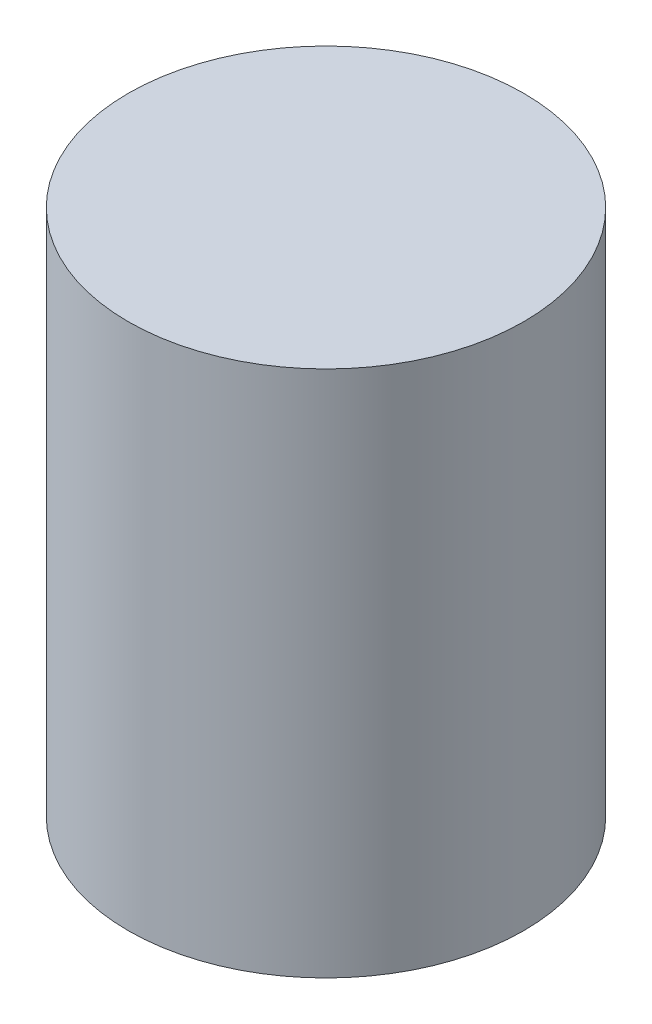
ISO-10303-21;
HEADER;
FILE_DESCRIPTION(('STEP AP214'),'2;1');
FILE_NAME('part.step','',(''),(''),'','','');
FILE_SCHEMA(('AUTOMOTIVE_DESIGN { 1 0 10303 214 1 1 1 1 }'));
ENDSEC;
DATA;
#1=APPLICATION_CONTEXT('core data for automotive mechanical design processes');
#2=APPLICATION_PROTOCOL_DEFINITION('international standard','automotive_design',2000,#1);
#3=PRODUCT_CONTEXT('',#1,'mechanical');
#4=PRODUCT('Part','Part','',(#3));
#5=PRODUCT_RELATED_PRODUCT_CATEGORY('part','',(#4));
#6=PRODUCT_DEFINITION_FORMATION('','',#4);
#7=PRODUCT_DEFINITION_CONTEXT('part definition',#1,'design');
#8=PRODUCT_DEFINITION('design','',#6,#7);
#9=PRODUCT_DEFINITION_SHAPE('','',#8);
#10=(LENGTH_UNIT() NAMED_UNIT(*) SI_UNIT(.MILLI.,.METRE.));
#11=(NAMED_UNIT(*) PLANE_ANGLE_UNIT() SI_UNIT($,.RADIAN.));
#12=(NAMED_UNIT(*) SI_UNIT($,.STERADIAN.) SOLID_ANGLE_UNIT());
#13=UNCERTAINTY_MEASURE_WITH_UNIT(LENGTH_MEASURE(1.E-05),#10,'distance_accuracy_value','');
#14=(GEOMETRIC_REPRESENTATION_CONTEXT(3) GLOBAL_UNCERTAINTY_ASSIGNED_CONTEXT((#13)) GLOBAL_UNIT_ASSIGNED_CONTEXT((#10,
#11,#12)) REPRESENTATION_CONTEXT('',''));
#15=CARTESIAN_POINT('',(0.,0.,0.));
#16=DIRECTION('',(0.,0.,1.));
#17=DIRECTION('',(1.,0.,0.));
#18=AXIS2_PLACEMENT_3D('',#15,#16,#17);
#19=CARTESIAN_POINT('',(0.,4.,0.));
#20=DIRECTION('',(0.,-1.,0.));
#21=DIRECTION('',(0.,0.,-1.));
#22=AXIS2_PLACEMENT_3D('',#19,#20,#21);
#23=CYLINDRICAL_SURFACE('',#22,1.5);
#24=CARTESIAN_POINT('',(0.,4.,0.));
#25=DIRECTION('',(0.,1.,0.));
#26=DIRECTION('',(0.,0.,1.));
#27=AXIS2_PLACEMENT_3D('',#24,#25,#26);
#28=CIRCLE('',#27,1.5);
#29=CARTESIAN_POINT('',(0.,4.,1.5));
#30=VERTEX_POINT('',#29);
#31=EDGE_CURVE('E10',#30,#30,#28,.T.);
#32=ORIENTED_EDGE('',*,*,#31,.F.);
#33=EDGE_LOOP('',(#32));
#34=FACE_BOUND('',#33,.T.);
#35=CARTESIAN_POINT('',(0.,0.,0.));
#36=DIRECTION('',(0.,1.,0.));
#37=DIRECTION('',(0.,0.,1.));
#38=AXIS2_PLACEMENT_3D('',#35,#36,#37);
#39=CIRCLE('',#38,1.5);
#40=CARTESIAN_POINT('',(0.,0.,1.5));
#41=VERTEX_POINT('',#40);
#42=EDGE_CURVE('E44',#41,#41,#39,.T.);
#43=ORIENTED_EDGE('',*,*,#42,.T.);
#44=EDGE_LOOP('',(#43));
#45=FACE_BOUND('',#44,.T.);
#46=ADVANCED_FACE('F41',(#34,#45),#23,.T.);
#47=CARTESIAN_POINT('',(0.,4.,0.));
#48=DIRECTION('',(0.,1.,0.));
#49=DIRECTION('',(0.,0.,1.));
#50=AXIS2_PLACEMENT_3D('',#47,#48,#49);
#51=PLANE('',#50);
#52=ORIENTED_EDGE('',*,*,#31,.T.);
#53=EDGE_LOOP('',(#52));
#54=FACE_BOUND('',#53,.T.);
#55=ADVANCED_FACE('F56',(#54),#51,.T.);
#56=CARTESIAN_POINT('',(0.,0.,0.));
#57=DIRECTION('',(0.,1.,0.));
#58=DIRECTION('',(0.,0.,1.));
#59=AXIS2_PLACEMENT_3D('',#56,#57,#58);
#60=PLANE('',#59);
#61=ORIENTED_EDGE('',*,*,#42,.F.);
#62=EDGE_LOOP('',(#61));
#63=FACE_BOUND('',#62,.T.);
#64=ADVANCED_FACE('F54',(#63),#60,.F.);
#65=CLOSED_SHELL('',(#46,#55,#64));
#66=MANIFOLD_SOLID_BREP('B2',#65);
#67=ADVANCED_BREP_SHAPE_REPRESENTATION('',(#18,#66),#14);
#68=SHAPE_DEFINITION_REPRESENTATION(#9,#67);
ENDSEC;
END-ISO-10303-21;
